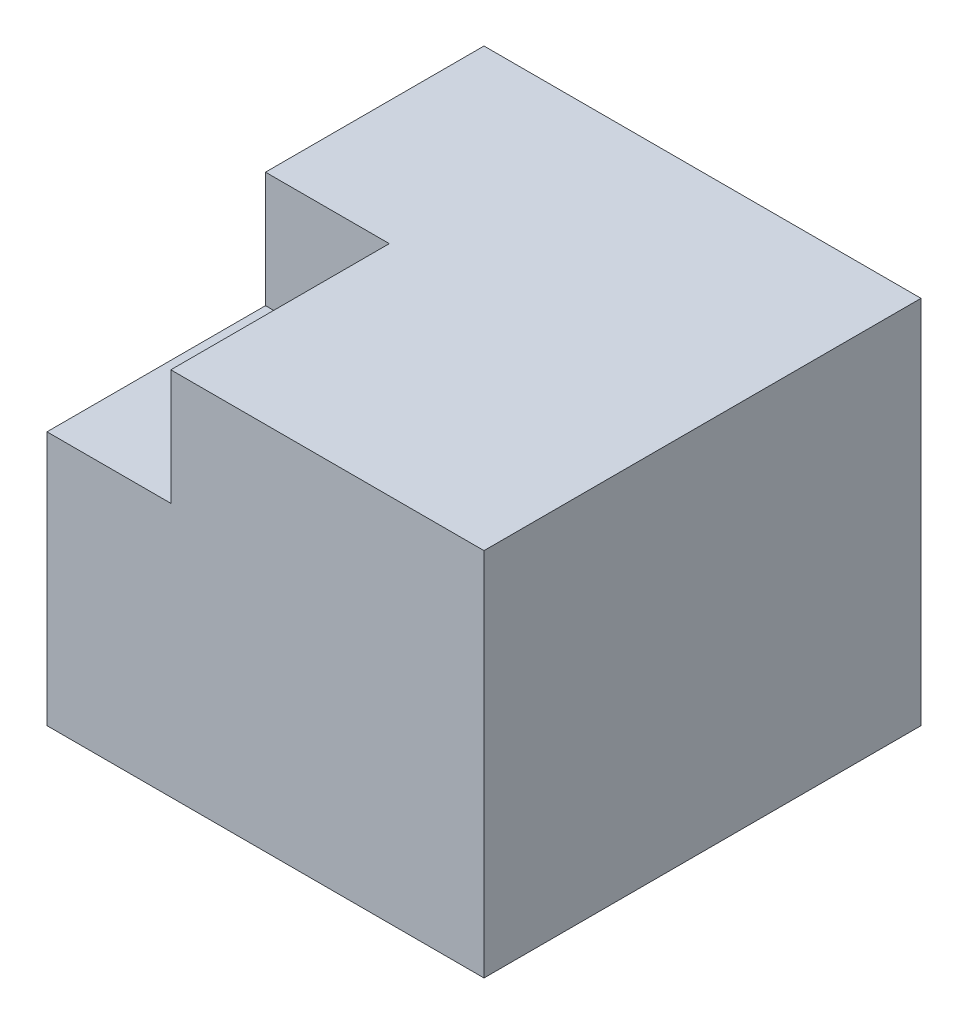
ISO-10303-21;
HEADER;
FILE_DESCRIPTION(('STEP AP214'),'2;1');
FILE_NAME('part.step','',(''),(''),'','','');
FILE_SCHEMA(('AUTOMOTIVE_DESIGN { 1 0 10303 214 1 1 1 1 }'));
ENDSEC;
DATA;
#1=APPLICATION_CONTEXT('core data for automotive mechanical design processes');
#2=APPLICATION_PROTOCOL_DEFINITION('international standard','automotive_design',2000,#1);
#3=PRODUCT_CONTEXT('',#1,'mechanical');
#4=PRODUCT('Part','Part','',(#3));
#5=PRODUCT_RELATED_PRODUCT_CATEGORY('part','',(#4));
#6=PRODUCT_DEFINITION_FORMATION('','',#4);
#7=PRODUCT_DEFINITION_CONTEXT('part definition',#1,'design');
#8=PRODUCT_DEFINITION('design','',#6,#7);
#9=PRODUCT_DEFINITION_SHAPE('','',#8);
#10=(LENGTH_UNIT() NAMED_UNIT(*) SI_UNIT(.MILLI.,.METRE.));
#11=(NAMED_UNIT(*) PLANE_ANGLE_UNIT() SI_UNIT($,.RADIAN.));
#12=(NAMED_UNIT(*) SI_UNIT($,.STERADIAN.) SOLID_ANGLE_UNIT());
#13=UNCERTAINTY_MEASURE_WITH_UNIT(LENGTH_MEASURE(1.E-05),#10,'distance_accuracy_value','');
#14=(GEOMETRIC_REPRESENTATION_CONTEXT(3) GLOBAL_UNCERTAINTY_ASSIGNED_CONTEXT((#13)) GLOBAL_UNIT_ASSIGNED_CONTEXT((#10,
#11,#12)) REPRESENTATION_CONTEXT('',''));
#15=CARTESIAN_POINT('',(0.,0.,0.));
#16=DIRECTION('',(0.,0.,1.));
#17=DIRECTION('',(1.,0.,0.));
#18=AXIS2_PLACEMENT_3D('',#15,#16,#17);
#19=CARTESIAN_POINT('',(-5.,-4.23469387755102,10.));
#20=DIRECTION('',(1.,0.,0.));
#21=DIRECTION('',(0.,0.,-1.));
#22=AXIS2_PLACEMENT_3D('',#19,#20,#21);
#23=PLANE('',#22);
#24=DIRECTION('',(0.,-1.,0.));
#25=VECTOR('',#24,1.);
#26=CARTESIAN_POINT('',(-5.,-4.23469387755102,10.));
#27=LINE('',#26,#25);
#28=CARTESIAN_POINT('',(-5.,1.58928704748504,10.));
#29=VERTEX_POINT('',#28);
#30=CARTESIAN_POINT('',(-5.,-4.23469387755102,10.));
#31=VERTEX_POINT('',#30);
#32=EDGE_CURVE('E81',#29,#31,#27,.T.);
#33=ORIENTED_EDGE('',*,*,#32,.F.);
#34=DIRECTION('',(0.,0.,1.));
#35=VECTOR('',#34,1.);
#36=CARTESIAN_POINT('',(-5.,1.58928704748504,5.));
#37=LINE('',#36,#35);
#38=CARTESIAN_POINT('',(-5.,1.58928704748504,5.));
#39=VERTEX_POINT('',#38);
#40=EDGE_CURVE('E47',#39,#29,#37,.T.);
#41=ORIENTED_EDGE('',*,*,#40,.F.);
#42=DIRECTION('',(0.,-1.,0.));
#43=VECTOR('',#42,1.);
#44=CARTESIAN_POINT('',(-5.,4.23469387755102,5.));
#45=LINE('',#44,#43);
#46=CARTESIAN_POINT('',(-5.,4.23469387755102,5.));
#47=VERTEX_POINT('',#46);
#48=EDGE_CURVE('E108',#47,#39,#45,.T.);
#49=ORIENTED_EDGE('',*,*,#48,.F.);
#50=DIRECTION('',(0.,0.,-1.));
#51=VECTOR('',#50,1.);
#52=CARTESIAN_POINT('',(-5.,4.23469387755102,10.));
#53=LINE('',#52,#51);
#54=CARTESIAN_POINT('',(-5.,4.23469387755102,0.));
#55=VERTEX_POINT('',#54);
#56=EDGE_CURVE('E77',#47,#55,#53,.T.);
#57=ORIENTED_EDGE('',*,*,#56,.T.);
#58=DIRECTION('',(0.,-1.,0.));
#59=VECTOR('',#58,1.);
#60=CARTESIAN_POINT('',(-5.,-4.23469387755102,0.));
#61=LINE('',#60,#59);
#62=CARTESIAN_POINT('',(-5.,-4.23469387755102,0.));
#63=VERTEX_POINT('',#62);
#64=EDGE_CURVE('E129',#55,#63,#61,.T.);
#65=ORIENTED_EDGE('',*,*,#64,.T.);
#66=DIRECTION('',(0.,0.,-1.));
#67=VECTOR('',#66,1.);
#68=CARTESIAN_POINT('',(-5.,-4.23469387755102,10.));
#69=LINE('',#68,#67);
#70=EDGE_CURVE('E11',#31,#63,#69,.T.);
#71=ORIENTED_EDGE('',*,*,#70,.F.);
#72=EDGE_LOOP('',(#33,#41,#49,#57,#65,#71));
#73=FACE_BOUND('',#72,.T.);
#74=ADVANCED_FACE('F33',(#73),#23,.F.);
#75=CARTESIAN_POINT('',(5.,-4.23469387755102,10.));
#76=DIRECTION('',(0.,1.,0.));
#77=DIRECTION('',(0.,0.,1.));
#78=AXIS2_PLACEMENT_3D('',#75,#76,#77);
#79=PLANE('',#78);
#80=DIRECTION('',(1.,0.,0.));
#81=VECTOR('',#80,1.);
#82=CARTESIAN_POINT('',(5.,-4.23469387755102,0.));
#83=LINE('',#82,#81);
#84=CARTESIAN_POINT('',(5.,-4.23469387755102,0.));
#85=VERTEX_POINT('',#84);
#86=EDGE_CURVE('E131',#63,#85,#83,.T.);
#87=ORIENTED_EDGE('',*,*,#86,.T.);
#88=DIRECTION('',(0.,0.,-1.));
#89=VECTOR('',#88,1.);
#90=CARTESIAN_POINT('',(5.,-4.23469387755102,10.));
#91=LINE('',#90,#89);
#92=CARTESIAN_POINT('',(5.,-4.23469387755102,10.));
#93=VERTEX_POINT('',#92);
#94=EDGE_CURVE('E40',#93,#85,#91,.T.);
#95=ORIENTED_EDGE('',*,*,#94,.F.);
#96=DIRECTION('',(1.,0.,0.));
#97=VECTOR('',#96,1.);
#98=CARTESIAN_POINT('',(5.,-4.23469387755102,10.));
#99=LINE('',#98,#97);
#100=EDGE_CURVE('E123',#31,#93,#99,.T.);
#101=ORIENTED_EDGE('',*,*,#100,.F.);
#102=ORIENTED_EDGE('',*,*,#70,.T.);
#103=EDGE_LOOP('',(#87,#95,#101,#102));
#104=FACE_BOUND('',#103,.T.);
#105=ADVANCED_FACE('F171',(#104),#79,.F.);
#106=CARTESIAN_POINT('',(5.,-4.23469387755102,10.));
#107=DIRECTION('',(-1.,0.,0.));
#108=DIRECTION('',(0.,0.,1.));
#109=AXIS2_PLACEMENT_3D('',#106,#107,#108);
#110=PLANE('',#109);
#111=DIRECTION('',(0.,1.,0.));
#112=VECTOR('',#111,1.);
#113=CARTESIAN_POINT('',(5.,-4.23469387755102,0.));
#114=LINE('',#113,#112);
#115=CARTESIAN_POINT('',(5.,4.23469387755102,0.));
#116=VERTEX_POINT('',#115);
#117=EDGE_CURVE('E133',#85,#116,#114,.T.);
#118=ORIENTED_EDGE('',*,*,#117,.T.);
#119=DIRECTION('',(0.,0.,-1.));
#120=VECTOR('',#119,1.);
#121=CARTESIAN_POINT('',(5.,4.23469387755102,10.));
#122=LINE('',#121,#120);
#123=CARTESIAN_POINT('',(5.,4.23469387755102,10.));
#124=VERTEX_POINT('',#123);
#125=EDGE_CURVE('E137',#124,#116,#122,.T.);
#126=ORIENTED_EDGE('',*,*,#125,.F.);
#127=DIRECTION('',(0.,1.,0.));
#128=VECTOR('',#127,1.);
#129=CARTESIAN_POINT('',(5.,-4.23469387755102,10.));
#130=LINE('',#129,#128);
#131=EDGE_CURVE('E56',#93,#124,#130,.T.);
#132=ORIENTED_EDGE('',*,*,#131,.F.);
#133=ORIENTED_EDGE('',*,*,#94,.T.);
#134=EDGE_LOOP('',(#118,#126,#132,#133));
#135=FACE_BOUND('',#134,.T.);
#136=ADVANCED_FACE('F143',(#135),#110,.F.);
#137=CARTESIAN_POINT('',(5.,4.23469387755102,10.));
#138=DIRECTION('',(0.,-1.,0.));
#139=DIRECTION('',(0.,0.,-1.));
#140=AXIS2_PLACEMENT_3D('',#137,#138,#139);
#141=PLANE('',#140);
#142=DIRECTION('',(-1.,0.,0.));
#143=VECTOR('',#142,1.);
#144=CARTESIAN_POINT('',(-5.,4.23469387755102,5.));
#145=LINE('',#144,#143);
#146=CARTESIAN_POINT('',(-2.1667096771941,4.23469387755102,5.));
#147=VERTEX_POINT('',#146);
#148=EDGE_CURVE('E112',#147,#47,#145,.T.);
#149=ORIENTED_EDGE('',*,*,#148,.F.);
#150=DIRECTION('',(0.,0.,1.));
#151=VECTOR('',#150,1.);
#152=CARTESIAN_POINT('',(-2.1667096771941,4.23469387755102,5.));
#153=LINE('',#152,#151);
#154=CARTESIAN_POINT('',(-2.1667096771941,4.23469387755102,10.));
#155=VERTEX_POINT('',#154);
#156=EDGE_CURVE('E117',#147,#155,#153,.T.);
#157=ORIENTED_EDGE('',*,*,#156,.T.);
#158=DIRECTION('',(-1.,0.,0.));
#159=VECTOR('',#158,1.);
#160=CARTESIAN_POINT('',(5.,4.23469387755102,10.));
#161=LINE('',#160,#159);
#162=EDGE_CURVE('E127',#124,#155,#161,.T.);
#163=ORIENTED_EDGE('',*,*,#162,.F.);
#164=ORIENTED_EDGE('',*,*,#125,.T.);
#165=DIRECTION('',(-1.,0.,0.));
#166=VECTOR('',#165,1.);
#167=CARTESIAN_POINT('',(5.,4.23469387755102,0.));
#168=LINE('',#167,#166);
#169=EDGE_CURVE('E124',#116,#55,#168,.T.);
#170=ORIENTED_EDGE('',*,*,#169,.T.);
#171=ORIENTED_EDGE('',*,*,#56,.F.);
#172=EDGE_LOOP('',(#149,#157,#163,#164,#170,#171));
#173=FACE_BOUND('',#172,.T.);
#174=ADVANCED_FACE('F150',(#173),#141,.F.);
#175=CARTESIAN_POINT('',(0.,0.,10.));
#176=DIRECTION('',(0.,0.,1.));
#177=DIRECTION('',(1.,0.,0.));
#178=AXIS2_PLACEMENT_3D('',#175,#176,#177);
#179=PLANE('',#178);
#180=DIRECTION('',(0.,1.,0.));
#181=VECTOR('',#180,1.);
#182=CARTESIAN_POINT('',(-2.1667096771941,4.23469387755102,10.));
#183=LINE('',#182,#181);
#184=CARTESIAN_POINT('',(-2.1667096771941,1.58928704748504,10.));
#185=VERTEX_POINT('',#184);
#186=EDGE_CURVE('E113',#185,#155,#183,.T.);
#187=ORIENTED_EDGE('',*,*,#186,.F.);
#188=DIRECTION('',(1.,0.,0.));
#189=VECTOR('',#188,1.);
#190=CARTESIAN_POINT('',(-5.,1.58928704748504,10.));
#191=LINE('',#190,#189);
#192=EDGE_CURVE('E155',#29,#185,#191,.T.);
#193=ORIENTED_EDGE('',*,*,#192,.F.);
#194=ORIENTED_EDGE('',*,*,#32,.T.);
#195=ORIENTED_EDGE('',*,*,#100,.T.);
#196=ORIENTED_EDGE('',*,*,#131,.T.);
#197=ORIENTED_EDGE('',*,*,#162,.T.);
#198=EDGE_LOOP('',(#187,#193,#194,#195,#196,#197));
#199=FACE_BOUND('',#198,.T.);
#200=ADVANCED_FACE('F154',(#199),#179,.T.);
#201=CARTESIAN_POINT('',(0.,0.,0.));
#202=DIRECTION('',(0.,0.,1.));
#203=DIRECTION('',(1.,0.,0.));
#204=AXIS2_PLACEMENT_3D('',#201,#202,#203);
#205=PLANE('',#204);
#206=ORIENTED_EDGE('',*,*,#64,.F.);
#207=ORIENTED_EDGE('',*,*,#169,.F.);
#208=ORIENTED_EDGE('',*,*,#117,.F.);
#209=ORIENTED_EDGE('',*,*,#86,.F.);
#210=EDGE_LOOP('',(#206,#207,#208,#209));
#211=FACE_BOUND('',#210,.T.);
#212=ADVANCED_FACE('F148',(#211),#205,.F.);
#213=CARTESIAN_POINT('',(-2.1667096771941,4.23469387755102,5.));
#214=DIRECTION('',(1.,0.,0.));
#215=DIRECTION('',(0.,0.,-1.));
#216=AXIS2_PLACEMENT_3D('',#213,#214,#215);
#217=PLANE('',#216);
#218=ORIENTED_EDGE('',*,*,#186,.T.);
#219=ORIENTED_EDGE('',*,*,#156,.F.);
#220=DIRECTION('',(0.,1.,0.));
#221=VECTOR('',#220,1.);
#222=CARTESIAN_POINT('',(-2.1667096771941,4.23469387755102,5.));
#223=LINE('',#222,#221);
#224=CARTESIAN_POINT('',(-2.1667096771941,1.58928704748504,5.));
#225=VERTEX_POINT('',#224);
#226=EDGE_CURVE('E107',#225,#147,#223,.T.);
#227=ORIENTED_EDGE('',*,*,#226,.F.);
#228=DIRECTION('',(0.,0.,1.));
#229=VECTOR('',#228,1.);
#230=CARTESIAN_POINT('',(-2.1667096771941,1.58928704748504,5.));
#231=LINE('',#230,#229);
#232=EDGE_CURVE('E103',#225,#185,#231,.T.);
#233=ORIENTED_EDGE('',*,*,#232,.T.);
#234=EDGE_LOOP('',(#218,#219,#227,#233));
#235=FACE_BOUND('',#234,.T.);
#236=ADVANCED_FACE('F160',(#235),#217,.F.);
#237=CARTESIAN_POINT('',(-5.,1.58928704748504,5.));
#238=DIRECTION('',(0.,-1.,0.));
#239=DIRECTION('',(0.,0.,-1.));
#240=AXIS2_PLACEMENT_3D('',#237,#238,#239);
#241=PLANE('',#240);
#242=ORIENTED_EDGE('',*,*,#192,.T.);
#243=ORIENTED_EDGE('',*,*,#232,.F.);
#244=DIRECTION('',(1.,0.,0.));
#245=VECTOR('',#244,1.);
#246=CARTESIAN_POINT('',(-5.,1.58928704748504,5.));
#247=LINE('',#246,#245);
#248=EDGE_CURVE('E100',#39,#225,#247,.T.);
#249=ORIENTED_EDGE('',*,*,#248,.F.);
#250=ORIENTED_EDGE('',*,*,#40,.T.);
#251=EDGE_LOOP('',(#242,#243,#249,#250));
#252=FACE_BOUND('',#251,.T.);
#253=ADVANCED_FACE('F102',(#252),#241,.F.);
#254=CARTESIAN_POINT('',(0.,0.,5.));
#255=DIRECTION('',(0.,0.,1.));
#256=DIRECTION('',(1.,0.,0.));
#257=AXIS2_PLACEMENT_3D('',#254,#255,#256);
#258=PLANE('',#257);
#259=ORIENTED_EDGE('',*,*,#48,.T.);
#260=ORIENTED_EDGE('',*,*,#248,.T.);
#261=ORIENTED_EDGE('',*,*,#226,.T.);
#262=ORIENTED_EDGE('',*,*,#148,.T.);
#263=EDGE_LOOP('',(#259,#260,#261,#262));
#264=FACE_BOUND('',#263,.T.);
#265=ADVANCED_FACE('F110',(#264),#258,.T.);
#266=CLOSED_SHELL('',(#74,#105,#136,#174,#200,#212,#236,#253,#265));
#267=MANIFOLD_SOLID_BREP('B2',#266);
#268=ADVANCED_BREP_SHAPE_REPRESENTATION('',(#18,#267),#14);
#269=SHAPE_DEFINITION_REPRESENTATION(#9,#268);
ENDSEC;
END-ISO-10303-21;
